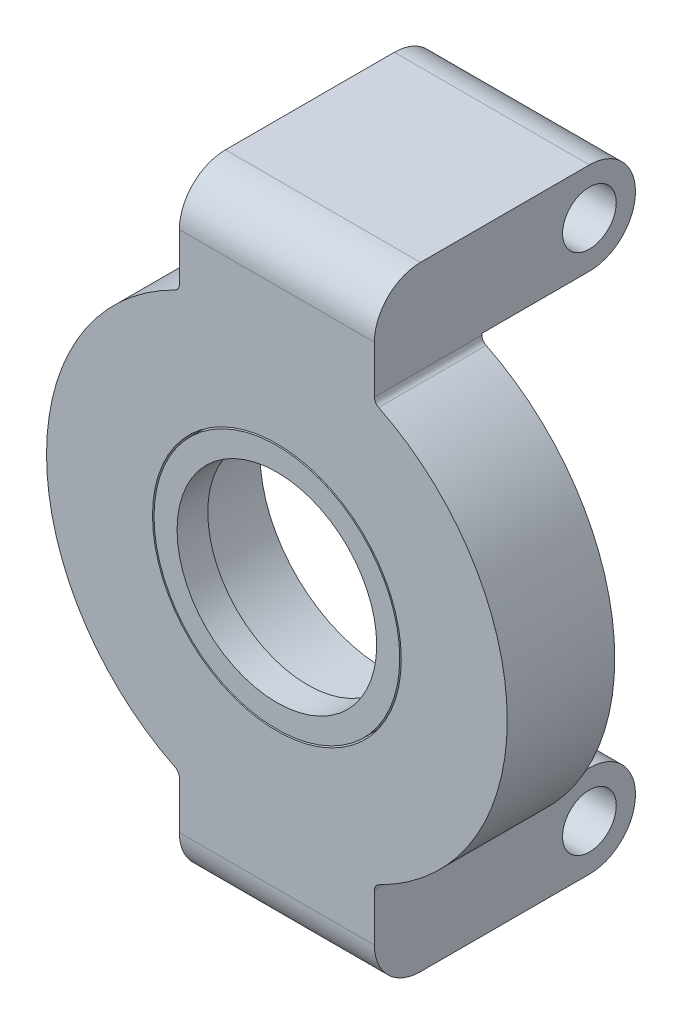
ISO-10303-21;
HEADER;
FILE_DESCRIPTION(('STEP AP214'),'2;1');
FILE_NAME('part.step','',(''),(''),'','','');
FILE_SCHEMA(('AUTOMOTIVE_DESIGN { 1 0 10303 214 1 1 1 1 }'));
ENDSEC;
DATA;
#1=APPLICATION_CONTEXT('core data for automotive mechanical design processes');
#2=APPLICATION_PROTOCOL_DEFINITION('international standard','automotive_design',2000,#1);
#3=PRODUCT_CONTEXT('',#1,'mechanical');
#4=PRODUCT('Part','Part','',(#3));
#5=PRODUCT_RELATED_PRODUCT_CATEGORY('part','',(#4));
#6=PRODUCT_DEFINITION_FORMATION('','',#4);
#7=PRODUCT_DEFINITION_CONTEXT('part definition',#1,'design');
#8=PRODUCT_DEFINITION('design','',#6,#7);
#9=PRODUCT_DEFINITION_SHAPE('','',#8);
#10=(LENGTH_UNIT() NAMED_UNIT(*) SI_UNIT(.MILLI.,.METRE.));
#11=(NAMED_UNIT(*) PLANE_ANGLE_UNIT() SI_UNIT($,.RADIAN.));
#12=(NAMED_UNIT(*) SI_UNIT($,.STERADIAN.) SOLID_ANGLE_UNIT());
#13=UNCERTAINTY_MEASURE_WITH_UNIT(LENGTH_MEASURE(1.E-05),#10,'distance_accuracy_value','');
#14=(GEOMETRIC_REPRESENTATION_CONTEXT(3) GLOBAL_UNCERTAINTY_ASSIGNED_CONTEXT((#13)) GLOBAL_UNIT_ASSIGNED_CONTEXT((#10,
#11,#12)) REPRESENTATION_CONTEXT('',''));
#15=CARTESIAN_POINT('',(0.,0.,0.));
#16=DIRECTION('',(0.,0.,1.));
#17=DIRECTION('',(1.,0.,0.));
#18=AXIS2_PLACEMENT_3D('',#15,#16,#17);
#19=CARTESIAN_POINT('',(0.,0.,5.));
#20=DIRECTION('',(0.,0.,1.));
#21=DIRECTION('',(1.,0.,0.));
#22=AXIS2_PLACEMENT_3D('',#19,#20,#21);
#23=CYLINDRICAL_SURFACE('',#22,7.99999999999999);
#24=CARTESIAN_POINT('',(0.,0.,5.));
#25=DIRECTION('',(0.,0.,1.));
#26=DIRECTION('',(1.,0.,0.));
#27=AXIS2_PLACEMENT_3D('',#24,#25,#26);
#28=CIRCLE('',#27,7.99999999999999);
#29=CARTESIAN_POINT('',(7.99999999999998,0.,5.));
#30=VERTEX_POINT('',#29);
#31=EDGE_CURVE('E11',#30,#30,#28,.T.);
#32=ORIENTED_EDGE('',*,*,#31,.T.);
#33=EDGE_LOOP('',(#32));
#34=FACE_BOUND('',#33,.T.);
#35=CARTESIAN_POINT('',(0.,0.,7.));
#36=DIRECTION('',(0.,0.,1.));
#37=DIRECTION('',(1.,0.,0.));
#38=AXIS2_PLACEMENT_3D('',#35,#36,#37);
#39=CIRCLE('',#38,7.99999999999999);
#40=CARTESIAN_POINT('',(7.99999999999998,0.,7.));
#41=VERTEX_POINT('',#40);
#42=EDGE_CURVE('E48',#41,#41,#39,.T.);
#43=ORIENTED_EDGE('',*,*,#42,.F.);
#44=EDGE_LOOP('',(#43));
#45=FACE_BOUND('',#44,.T.);
#46=ADVANCED_FACE('F45',(#34,#45),#23,.T.);
#47=CARTESIAN_POINT('',(0.,0.,5.));
#48=DIRECTION('',(0.,0.,1.));
#49=DIRECTION('',(1.,0.,0.));
#50=AXIS2_PLACEMENT_3D('',#47,#48,#49);
#51=PLANE('',#50);
#52=CARTESIAN_POINT('',(0.,0.,5.));
#53=DIRECTION('',(0.,0.,1.));
#54=DIRECTION('',(1.,0.,0.));
#55=AXIS2_PLACEMENT_3D('',#52,#53,#54);
#56=CIRCLE('',#55,6.5);
#57=CARTESIAN_POINT('',(6.5,0.,5.));
#58=VERTEX_POINT('',#57);
#59=EDGE_CURVE('E55',#58,#58,#56,.T.);
#60=ORIENTED_EDGE('',*,*,#59,.T.);
#61=EDGE_LOOP('',(#60));
#62=FACE_BOUND('',#61,.T.);
#63=ORIENTED_EDGE('',*,*,#31,.F.);
#64=EDGE_LOOP('',(#63));
#65=FACE_BOUND('',#64,.T.);
#66=ADVANCED_FACE('F63',(#62,#65),#51,.F.);
#67=CARTESIAN_POINT('',(0.,0.,7.));
#68=DIRECTION('',(0.,0.,1.));
#69=DIRECTION('',(1.,0.,0.));
#70=AXIS2_PLACEMENT_3D('',#67,#68,#69);
#71=PLANE('',#70);
#72=CARTESIAN_POINT('',(0.,0.,7.));
#73=DIRECTION('',(0.,0.,1.));
#74=DIRECTION('',(1.,0.,0.));
#75=AXIS2_PLACEMENT_3D('',#72,#73,#74);
#76=CIRCLE('',#75,6.5);
#77=CARTESIAN_POINT('',(6.5,0.,7.));
#78=VERTEX_POINT('',#77);
#79=EDGE_CURVE('E57',#78,#78,#76,.T.);
#80=ORIENTED_EDGE('',*,*,#79,.F.);
#81=EDGE_LOOP('',(#80));
#82=FACE_BOUND('',#81,.T.);
#83=ORIENTED_EDGE('',*,*,#42,.T.);
#84=EDGE_LOOP('',(#83));
#85=FACE_BOUND('',#84,.T.);
#86=ADVANCED_FACE('F69',(#82,#85),#71,.T.);
#87=CARTESIAN_POINT('',(0.,0.,5.));
#88=DIRECTION('',(0.,0.,1.));
#89=DIRECTION('',(1.,0.,0.));
#90=AXIS2_PLACEMENT_3D('',#87,#88,#89);
#91=CYLINDRICAL_SURFACE('',#90,6.5);
#92=ORIENTED_EDGE('',*,*,#59,.F.);
#93=EDGE_LOOP('',(#92));
#94=FACE_BOUND('',#93,.T.);
#95=ORIENTED_EDGE('',*,*,#79,.T.);
#96=EDGE_LOOP('',(#95));
#97=FACE_BOUND('',#96,.T.);
#98=ADVANCED_FACE('F66',(#94,#97),#91,.F.);
#99=CLOSED_SHELL('',(#46,#66,#86,#98));
#100=MANIFOLD_SOLID_BREP('B2',#99);
#101=CARTESIAN_POINT('',(0.,0.,0.));
#102=DIRECTION('',(0.,0.,1.));
#103=DIRECTION('',(1.,0.,0.));
#104=AXIS2_PLACEMENT_3D('',#101,#102,#103);
#105=PLANE('',#104);
#106=CARTESIAN_POINT('',(0.,0.,0.));
#107=DIRECTION('',(0.,0.,1.));
#108=DIRECTION('',(1.,0.,0.));
#109=AXIS2_PLACEMENT_3D('',#106,#107,#108);
#110=CIRCLE('',#109,8.1);
#111=CARTESIAN_POINT('',(8.1,0.,0.));
#112=VERTEX_POINT('',#111);
#113=EDGE_CURVE('E288',#112,#112,#110,.T.);
#114=ORIENTED_EDGE('',*,*,#113,.T.);
#115=EDGE_LOOP('',(#114));
#116=FACE_BOUND('',#115,.T.);
#117=DIRECTION('',(1.,0.,0.));
#118=VECTOR('',#117,1.);
#119=CARTESIAN_POINT('',(6.34999999999999,-14.,0.));
#120=LINE('',#119,#118);
#121=CARTESIAN_POINT('',(-6.35,-14.,0.));
#122=VERTEX_POINT('',#121);
#123=CARTESIAN_POINT('',(6.35,-14.,0.));
#124=VERTEX_POINT('',#123);
#125=EDGE_CURVE('E269',#122,#124,#120,.T.);
#126=ORIENTED_EDGE('',*,*,#125,.F.);
#127=DIRECTION('',(0.,-1.,0.));
#128=VECTOR('',#127,1.);
#129=CARTESIAN_POINT('',(-6.35,-20.,0.));
#130=LINE('',#129,#128);
#131=CARTESIAN_POINT('',(-6.35,-13.9042259762994,0.));
#132=VERTEX_POINT('',#131);
#133=EDGE_CURVE('E252',#132,#122,#130,.T.);
#134=ORIENTED_EDGE('',*,*,#133,.F.);
#135=CARTESIAN_POINT('',(-6.85,-13.9042259762994,0.));
#136=DIRECTION('',(0.,0.,1.));
#137=DIRECTION('',(1.,0.,0.));
#138=AXIS2_PLACEMENT_3D('',#135,#136,#137);
#139=CIRCLE('',#138,0.5);
#140=CARTESIAN_POINT('',(-6.62903225806452,-13.4557025577091,0.));
#141=VERTEX_POINT('',#140);
#142=EDGE_CURVE('E406',#132,#141,#139,.T.);
#143=ORIENTED_EDGE('',*,*,#142,.T.);
#144=CARTESIAN_POINT('',(0.,0.,0.));
#145=DIRECTION('',(0.,0.,1.));
#146=DIRECTION('',(1.,0.,0.));
#147=AXIS2_PLACEMENT_3D('',#144,#145,#146);
#148=CIRCLE('',#147,15.);
#149=CARTESIAN_POINT('',(-6.62903225806452,13.4557025577091,0.));
#150=VERTEX_POINT('',#149);
#151=EDGE_CURVE('E262',#150,#141,#148,.T.);
#152=ORIENTED_EDGE('',*,*,#151,.F.);
#153=CARTESIAN_POINT('',(-6.85,13.9042259762994,0.));
#154=DIRECTION('',(0.,0.,1.));
#155=DIRECTION('',(1.,0.,0.));
#156=AXIS2_PLACEMENT_3D('',#153,#154,#155);
#157=CIRCLE('',#156,0.5);
#158=CARTESIAN_POINT('',(-6.35,13.9042259762994,0.));
#159=VERTEX_POINT('',#158);
#160=EDGE_CURVE('E402',#150,#159,#157,.T.);
#161=ORIENTED_EDGE('',*,*,#160,.T.);
#162=DIRECTION('',(0.,-1.,0.));
#163=VECTOR('',#162,1.);
#164=CARTESIAN_POINT('',(-6.35,13.5896100017624,0.));
#165=LINE('',#164,#163);
#166=CARTESIAN_POINT('',(-6.35,14.,0.));
#167=VERTEX_POINT('',#166);
#168=EDGE_CURVE('E313',#167,#159,#165,.T.);
#169=ORIENTED_EDGE('',*,*,#168,.F.);
#170=DIRECTION('',(-1.,0.,0.));
#171=VECTOR('',#170,1.);
#172=CARTESIAN_POINT('',(6.35,14.,0.));
#173=LINE('',#172,#171);
#174=CARTESIAN_POINT('',(6.35,14.,0.));
#175=VERTEX_POINT('',#174);
#176=EDGE_CURVE('E277',#175,#167,#173,.T.);
#177=ORIENTED_EDGE('',*,*,#176,.F.);
#178=DIRECTION('',(0.,1.,0.));
#179=VECTOR('',#178,1.);
#180=CARTESIAN_POINT('',(6.35,13.5896100017624,0.));
#181=LINE('',#180,#179);
#182=CARTESIAN_POINT('',(6.35,13.9042259762994,0.));
#183=VERTEX_POINT('',#182);
#184=EDGE_CURVE('E292',#183,#175,#181,.T.);
#185=ORIENTED_EDGE('',*,*,#184,.F.);
#186=CARTESIAN_POINT('',(6.85,13.9042259762994,0.));
#187=DIRECTION('',(0.,0.,1.));
#188=DIRECTION('',(1.,0.,0.));
#189=AXIS2_PLACEMENT_3D('',#186,#187,#188);
#190=CIRCLE('',#189,0.5);
#191=CARTESIAN_POINT('',(6.62903225806452,13.4557025577091,0.));
#192=VERTEX_POINT('',#191);
#193=EDGE_CURVE('E123',#183,#192,#190,.T.);
#194=ORIENTED_EDGE('',*,*,#193,.T.);
#195=CARTESIAN_POINT('',(0.,0.,0.));
#196=DIRECTION('',(0.,0.,1.));
#197=DIRECTION('',(1.,0.,0.));
#198=AXIS2_PLACEMENT_3D('',#195,#196,#197);
#199=CIRCLE('',#198,15.);
#200=CARTESIAN_POINT('',(6.62903225806452,-13.4557025577091,0.));
#201=VERTEX_POINT('',#200);
#202=EDGE_CURVE('E298',#201,#192,#199,.T.);
#203=ORIENTED_EDGE('',*,*,#202,.F.);
#204=CARTESIAN_POINT('',(6.85,-13.9042259762994,0.));
#205=DIRECTION('',(0.,0.,1.));
#206=DIRECTION('',(1.,0.,0.));
#207=AXIS2_PLACEMENT_3D('',#204,#205,#206);
#208=CIRCLE('',#207,0.5);
#209=CARTESIAN_POINT('',(6.35,-13.9042259762994,0.));
#210=VERTEX_POINT('',#209);
#211=EDGE_CURVE('E410',#201,#210,#208,.T.);
#212=ORIENTED_EDGE('',*,*,#211,.T.);
#213=DIRECTION('',(0.,1.,0.));
#214=VECTOR('',#213,1.);
#215=CARTESIAN_POINT('',(6.35,-20.,0.));
#216=LINE('',#215,#214);
#217=EDGE_CURVE('E261',#124,#210,#216,.T.);
#218=ORIENTED_EDGE('',*,*,#217,.F.);
#219=EDGE_LOOP('',(#126,#134,#143,#152,#161,#169,#177,#185,#194,#203,#212,#218));
#220=FACE_BOUND('',#219,.T.);
#221=ADVANCED_FACE('F115',(#116,#220),#105,.F.);
#222=CARTESIAN_POINT('',(0.,0.,7.));
#223=DIRECTION('',(0.,0.,1.));
#224=DIRECTION('',(1.,0.,0.));
#225=AXIS2_PLACEMENT_3D('',#222,#223,#224);
#226=PLANE('',#225);
#227=CARTESIAN_POINT('',(0.,0.,7.));
#228=DIRECTION('',(0.,0.,1.));
#229=DIRECTION('',(1.,0.,0.));
#230=AXIS2_PLACEMENT_3D('',#227,#228,#229);
#231=CIRCLE('',#230,15.);
#232=CARTESIAN_POINT('',(-6.62903225806452,13.4557025577091,7.));
#233=VERTEX_POINT('',#232);
#234=CARTESIAN_POINT('',(-6.62903225806452,-13.4557025577091,7.));
#235=VERTEX_POINT('',#234);
#236=EDGE_CURVE('E301',#233,#235,#231,.T.);
#237=ORIENTED_EDGE('',*,*,#236,.T.);
#238=CARTESIAN_POINT('',(-6.85,-13.9042259762994,7.));
#239=DIRECTION('',(0.,0.,1.));
#240=DIRECTION('',(1.,0.,0.));
#241=AXIS2_PLACEMENT_3D('',#238,#239,#240);
#242=CIRCLE('',#241,0.5);
#243=CARTESIAN_POINT('',(-6.35,-13.9042259762994,7.));
#244=VERTEX_POINT('',#243);
#245=EDGE_CURVE('E408',#235,#244,#242,.F.);
#246=ORIENTED_EDGE('',*,*,#245,.T.);
#247=DIRECTION('',(0.,-1.,0.));
#248=VECTOR('',#247,1.);
#249=CARTESIAN_POINT('',(-6.35,-20.,7.));
#250=LINE('',#249,#248);
#251=CARTESIAN_POINT('',(-6.35,-17.,7.));
#252=VERTEX_POINT('',#251);
#253=EDGE_CURVE('E304',#244,#252,#250,.T.);
#254=ORIENTED_EDGE('',*,*,#253,.T.);
#255=DIRECTION('',(1.,0.,0.));
#256=VECTOR('',#255,1.);
#257=CARTESIAN_POINT('',(6.35,-17.,7.));
#258=LINE('',#257,#256);
#259=CARTESIAN_POINT('',(6.35,-17.,7.));
#260=VERTEX_POINT('',#259);
#261=EDGE_CURVE('E368',#252,#260,#258,.T.);
#262=ORIENTED_EDGE('',*,*,#261,.T.);
#263=DIRECTION('',(0.,1.,0.));
#264=VECTOR('',#263,1.);
#265=CARTESIAN_POINT('',(6.35,-20.,7.));
#266=LINE('',#265,#264);
#267=CARTESIAN_POINT('',(6.35,-13.9042259762994,7.));
#268=VERTEX_POINT('',#267);
#269=EDGE_CURVE('E306',#260,#268,#266,.T.);
#270=ORIENTED_EDGE('',*,*,#269,.T.);
#271=CARTESIAN_POINT('',(6.85,-13.9042259762994,7.));
#272=DIRECTION('',(0.,0.,1.));
#273=DIRECTION('',(1.,0.,0.));
#274=AXIS2_PLACEMENT_3D('',#271,#272,#273);
#275=CIRCLE('',#274,0.5);
#276=CARTESIAN_POINT('',(6.62903225806452,-13.4557025577091,7.));
#277=VERTEX_POINT('',#276);
#278=EDGE_CURVE('E412',#268,#277,#275,.F.);
#279=ORIENTED_EDGE('',*,*,#278,.T.);
#280=CARTESIAN_POINT('',(0.,0.,7.));
#281=DIRECTION('',(0.,0.,1.));
#282=DIRECTION('',(1.,0.,0.));
#283=AXIS2_PLACEMENT_3D('',#280,#281,#282);
#284=CIRCLE('',#283,15.);
#285=CARTESIAN_POINT('',(6.62903225806452,13.4557025577091,7.));
#286=VERTEX_POINT('',#285);
#287=EDGE_CURVE('E309',#277,#286,#284,.T.);
#288=ORIENTED_EDGE('',*,*,#287,.T.);
#289=CARTESIAN_POINT('',(6.85,13.9042259762994,7.));
#290=DIRECTION('',(0.,0.,1.));
#291=DIRECTION('',(1.,0.,0.));
#292=AXIS2_PLACEMENT_3D('',#289,#290,#291);
#293=CIRCLE('',#292,0.5);
#294=CARTESIAN_POINT('',(6.35,13.9042259762994,7.));
#295=VERTEX_POINT('',#294);
#296=EDGE_CURVE('E43',#286,#295,#293,.F.);
#297=ORIENTED_EDGE('',*,*,#296,.T.);
#298=DIRECTION('',(0.,1.,0.));
#299=VECTOR('',#298,1.);
#300=CARTESIAN_POINT('',(6.35,13.5896100017624,7.));
#301=LINE('',#300,#299);
#302=CARTESIAN_POINT('',(6.35,17.,7.));
#303=VERTEX_POINT('',#302);
#304=EDGE_CURVE('E295',#295,#303,#301,.T.);
#305=ORIENTED_EDGE('',*,*,#304,.T.);
#306=DIRECTION('',(-1.,0.,0.));
#307=VECTOR('',#306,1.);
#308=CARTESIAN_POINT('',(-6.35,17.,7.));
#309=LINE('',#308,#307);
#310=CARTESIAN_POINT('',(-6.35,17.,7.));
#311=VERTEX_POINT('',#310);
#312=EDGE_CURVE('E356',#303,#311,#309,.T.);
#313=ORIENTED_EDGE('',*,*,#312,.T.);
#314=DIRECTION('',(0.,-1.,0.));
#315=VECTOR('',#314,1.);
#316=CARTESIAN_POINT('',(-6.35,13.5896100017624,7.));
#317=LINE('',#316,#315);
#318=CARTESIAN_POINT('',(-6.35,13.9042259762994,7.));
#319=VERTEX_POINT('',#318);
#320=EDGE_CURVE('E297',#311,#319,#317,.T.);
#321=ORIENTED_EDGE('',*,*,#320,.T.);
#322=CARTESIAN_POINT('',(-6.85,13.9042259762994,7.));
#323=DIRECTION('',(0.,0.,1.));
#324=DIRECTION('',(1.,0.,0.));
#325=AXIS2_PLACEMENT_3D('',#322,#323,#324);
#326=CIRCLE('',#325,0.5);
#327=EDGE_CURVE('E404',#319,#233,#326,.F.);
#328=ORIENTED_EDGE('',*,*,#327,.T.);
#329=EDGE_LOOP('',(#237,#246,#254,#262,#270,#279,#288,#297,#305,#313,#321,#328));
#330=FACE_BOUND('',#329,.T.);
#331=CARTESIAN_POINT('',(0.,0.,7.));
#332=DIRECTION('',(0.,0.,1.));
#333=DIRECTION('',(1.,0.,0.));
#334=AXIS2_PLACEMENT_3D('',#331,#332,#333);
#335=CIRCLE('',#334,8.1);
#336=CARTESIAN_POINT('',(8.1,0.,7.));
#337=VERTEX_POINT('',#336);
#338=EDGE_CURVE('E289',#337,#337,#335,.T.);
#339=ORIENTED_EDGE('',*,*,#338,.F.);
#340=EDGE_LOOP('',(#339));
#341=FACE_BOUND('',#340,.T.);
#342=ADVANCED_FACE('F426',(#330,#341),#226,.T.);
#343=CARTESIAN_POINT('',(6.35,13.5896100017624,7.));
#344=DIRECTION('',(-1.,0.,0.));
#345=DIRECTION('',(0.,0.,1.));
#346=AXIS2_PLACEMENT_3D('',#343,#344,#345);
#347=PLANE('',#346);
#348=CARTESIAN_POINT('',(6.35,17.,-7.));
#349=DIRECTION('',(1.,0.,0.));
#350=DIRECTION('',(0.,0.,-1.));
#351=AXIS2_PLACEMENT_3D('',#348,#349,#350);
#352=CIRCLE('',#351,1.75);
#353=CARTESIAN_POINT('',(6.35,17.,-8.75));
#354=VERTEX_POINT('',#353);
#355=EDGE_CURVE('E770',#354,#354,#352,.T.);
#356=ORIENTED_EDGE('',*,*,#355,.F.);
#357=EDGE_LOOP('',(#356));
#358=FACE_BOUND('',#357,.T.);
#359=ORIENTED_EDGE('',*,*,#304,.F.);
#360=DIRECTION('',(0.,0.,1.));
#361=VECTOR('',#360,1.);
#362=CARTESIAN_POINT('',(6.35,13.9042259762994,0.));
#363=LINE('',#362,#361);
#364=EDGE_CURVE('E400',#295,#183,#363,.F.);
#365=ORIENTED_EDGE('',*,*,#364,.T.);
#366=ORIENTED_EDGE('',*,*,#184,.T.);
#367=DIRECTION('',(0.,0.,1.));
#368=VECTOR('',#367,1.);
#369=CARTESIAN_POINT('',(6.35,14.,-10.));
#370=LINE('',#369,#368);
#371=CARTESIAN_POINT('',(6.35,14.,-7.));
#372=VERTEX_POINT('',#371);
#373=EDGE_CURVE('E285',#372,#175,#370,.T.);
#374=ORIENTED_EDGE('',*,*,#373,.F.);
#375=CARTESIAN_POINT('',(6.35,17.,-7.));
#376=DIRECTION('',(-1.,0.,0.));
#377=DIRECTION('',(0.,0.,1.));
#378=AXIS2_PLACEMENT_3D('',#375,#376,#377);
#379=CIRCLE('',#378,3.);
#380=CARTESIAN_POINT('',(6.35,17.,-10.));
#381=VERTEX_POINT('',#380);
#382=EDGE_CURVE('E338',#372,#381,#379,.F.);
#383=ORIENTED_EDGE('',*,*,#382,.T.);
#384=CARTESIAN_POINT('',(6.35,17.,-7.));
#385=DIRECTION('',(-1.,0.,0.));
#386=DIRECTION('',(0.,0.,1.));
#387=AXIS2_PLACEMENT_3D('',#384,#385,#386);
#388=CIRCLE('',#387,3.);
#389=CARTESIAN_POINT('',(6.35,20.,-7.));
#390=VERTEX_POINT('',#389);
#391=EDGE_CURVE('E335',#381,#390,#388,.F.);
#392=ORIENTED_EDGE('',*,*,#391,.T.);
#393=DIRECTION('',(0.,0.,-1.));
#394=VECTOR('',#393,1.);
#395=CARTESIAN_POINT('',(6.35,20.,7.));
#396=LINE('',#395,#394);
#397=CARTESIAN_POINT('',(6.35,20.,4.));
#398=VERTEX_POINT('',#397);
#399=EDGE_CURVE('E326',#398,#390,#396,.T.);
#400=ORIENTED_EDGE('',*,*,#399,.F.);
#401=CARTESIAN_POINT('',(6.35,17.,4.));
#402=DIRECTION('',(-1.,0.,0.));
#403=DIRECTION('',(0.,0.,1.));
#404=AXIS2_PLACEMENT_3D('',#401,#402,#403);
#405=CIRCLE('',#404,3.);
#406=EDGE_CURVE('E382',#398,#303,#405,.F.);
#407=ORIENTED_EDGE('',*,*,#406,.T.);
#408=EDGE_LOOP('',(#359,#365,#366,#374,#383,#392,#400,#407));
#409=FACE_BOUND('',#408,.T.);
#410=ADVANCED_FACE('F421',(#358,#409),#347,.F.);
#411=CARTESIAN_POINT('',(-6.35,20.,7.));
#412=DIRECTION('',(0.,-1.,0.));
#413=DIRECTION('',(0.,0.,-1.));
#414=AXIS2_PLACEMENT_3D('',#411,#412,#413);
#415=PLANE('',#414);
#416=DIRECTION('',(0.,0.,-1.));
#417=VECTOR('',#416,1.);
#418=CARTESIAN_POINT('',(-6.35,20.,7.));
#419=LINE('',#418,#417);
#420=CARTESIAN_POINT('',(-6.35,20.,4.));
#421=VERTEX_POINT('',#420);
#422=CARTESIAN_POINT('',(-6.35,20.,-7.));
#423=VERTEX_POINT('',#422);
#424=EDGE_CURVE('E324',#421,#423,#419,.T.);
#425=ORIENTED_EDGE('',*,*,#424,.F.);
#426=DIRECTION('',(-1.,0.,0.));
#427=VECTOR('',#426,1.);
#428=CARTESIAN_POINT('',(6.35,20.,4.));
#429=LINE('',#428,#427);
#430=EDGE_CURVE('E380',#421,#398,#429,.F.);
#431=ORIENTED_EDGE('',*,*,#430,.T.);
#432=ORIENTED_EDGE('',*,*,#399,.T.);
#433=DIRECTION('',(1.,0.,0.));
#434=VECTOR('',#433,1.);
#435=CARTESIAN_POINT('',(-6.35,20.,-7.));
#436=LINE('',#435,#434);
#437=EDGE_CURVE('E340',#390,#423,#436,.F.);
#438=ORIENTED_EDGE('',*,*,#437,.T.);
#439=EDGE_LOOP('',(#425,#431,#432,#438));
#440=FACE_BOUND('',#439,.T.);
#441=ADVANCED_FACE('F493',(#440),#415,.F.);
#442=CARTESIAN_POINT('',(-6.35,13.5896100017624,7.));
#443=DIRECTION('',(1.,0.,0.));
#444=DIRECTION('',(0.,0.,-1.));
#445=AXIS2_PLACEMENT_3D('',#442,#443,#444);
#446=PLANE('',#445);
#447=CARTESIAN_POINT('',(-6.35,17.,-7.));
#448=DIRECTION('',(1.,0.,0.));
#449=DIRECTION('',(0.,0.,-1.));
#450=AXIS2_PLACEMENT_3D('',#447,#448,#449);
#451=CIRCLE('',#450,1.75);
#452=CARTESIAN_POINT('',(-6.35,17.,-8.75));
#453=VERTEX_POINT('',#452);
#454=EDGE_CURVE('E362',#453,#453,#451,.T.);
#455=ORIENTED_EDGE('',*,*,#454,.T.);
#456=EDGE_LOOP('',(#455));
#457=FACE_BOUND('',#456,.T.);
#458=ORIENTED_EDGE('',*,*,#168,.T.);
#459=DIRECTION('',(0.,0.,1.));
#460=VECTOR('',#459,1.);
#461=CARTESIAN_POINT('',(-6.35,13.9042259762994,7.));
#462=LINE('',#461,#460);
#463=EDGE_CURVE('E390',#159,#319,#462,.T.);
#464=ORIENTED_EDGE('',*,*,#463,.T.);
#465=ORIENTED_EDGE('',*,*,#320,.F.);
#466=CARTESIAN_POINT('',(-6.35,17.,4.));
#467=DIRECTION('',(1.,0.,0.));
#468=DIRECTION('',(0.,0.,-1.));
#469=AXIS2_PLACEMENT_3D('',#466,#467,#468);
#470=CIRCLE('',#469,3.);
#471=EDGE_CURVE('E378',#311,#421,#470,.F.);
#472=ORIENTED_EDGE('',*,*,#471,.T.);
#473=ORIENTED_EDGE('',*,*,#424,.T.);
#474=CARTESIAN_POINT('',(-6.35,17.,-7.));
#475=DIRECTION('',(1.,0.,0.));
#476=DIRECTION('',(0.,0.,-1.));
#477=AXIS2_PLACEMENT_3D('',#474,#475,#476);
#478=CIRCLE('',#477,3.);
#479=CARTESIAN_POINT('',(-6.35,17.,-10.));
#480=VERTEX_POINT('',#479);
#481=EDGE_CURVE('E328',#423,#480,#478,.F.);
#482=ORIENTED_EDGE('',*,*,#481,.T.);
#483=CARTESIAN_POINT('',(-6.35,17.,-7.));
#484=DIRECTION('',(1.,0.,0.));
#485=DIRECTION('',(0.,0.,-1.));
#486=AXIS2_PLACEMENT_3D('',#483,#484,#485);
#487=CIRCLE('',#486,3.);
#488=CARTESIAN_POINT('',(-6.35,14.,-7.));
#489=VERTEX_POINT('',#488);
#490=EDGE_CURVE('E330',#480,#489,#487,.F.);
#491=ORIENTED_EDGE('',*,*,#490,.T.);
#492=DIRECTION('',(0.,0.,1.));
#493=VECTOR('',#492,1.);
#494=CARTESIAN_POINT('',(-6.35,14.,-10.));
#495=LINE('',#494,#493);
#496=EDGE_CURVE('E280',#489,#167,#495,.T.);
#497=ORIENTED_EDGE('',*,*,#496,.T.);
#498=EDGE_LOOP('',(#458,#464,#465,#472,#473,#482,#491,#497));
#499=FACE_BOUND('',#498,.T.);
#500=ADVANCED_FACE('F432',(#457,#499),#446,.F.);
#501=CARTESIAN_POINT('',(0.,0.,7.));
#502=DIRECTION('',(0.,0.,-1.));
#503=DIRECTION('',(-1.,0.,0.));
#504=AXIS2_PLACEMENT_3D('',#501,#502,#503);
#505=CYLINDRICAL_SURFACE('',#504,15.);
#506=ORIENTED_EDGE('',*,*,#236,.F.);
#507=DIRECTION('',(0.,0.,-1.));
#508=VECTOR('',#507,1.);
#509=CARTESIAN_POINT('',(-6.62903225806452,13.4557025577091,7.));
#510=LINE('',#509,#508);
#511=EDGE_CURVE('E387',#233,#150,#510,.T.);
#512=ORIENTED_EDGE('',*,*,#511,.T.);
#513=ORIENTED_EDGE('',*,*,#151,.T.);
#514=DIRECTION('',(0.,0.,-1.));
#515=VECTOR('',#514,1.);
#516=CARTESIAN_POINT('',(-6.62903225806452,-13.4557025577091,7.));
#517=LINE('',#516,#515);
#518=EDGE_CURVE('E385',#141,#235,#517,.F.);
#519=ORIENTED_EDGE('',*,*,#518,.T.);
#520=EDGE_LOOP('',(#506,#512,#513,#519));
#521=FACE_BOUND('',#520,.T.);
#522=ADVANCED_FACE('F442',(#521),#505,.T.);
#523=CARTESIAN_POINT('',(-6.35,-20.,7.));
#524=DIRECTION('',(1.,0.,0.));
#525=DIRECTION('',(0.,0.,-1.));
#526=AXIS2_PLACEMENT_3D('',#523,#524,#525);
#527=PLANE('',#526);
#528=CARTESIAN_POINT('',(-6.35,-17.,-7.));
#529=DIRECTION('',(1.,0.,0.));
#530=DIRECTION('',(0.,0.,-1.));
#531=AXIS2_PLACEMENT_3D('',#528,#529,#530);
#532=CIRCLE('',#531,1.75);
#533=CARTESIAN_POINT('',(-6.35,-17.,-8.75));
#534=VERTEX_POINT('',#533);
#535=EDGE_CURVE('E365',#534,#534,#532,.T.);
#536=ORIENTED_EDGE('',*,*,#535,.T.);
#537=EDGE_LOOP('',(#536));
#538=FACE_BOUND('',#537,.T.);
#539=ORIENTED_EDGE('',*,*,#253,.F.);
#540=DIRECTION('',(0.,0.,1.));
#541=VECTOR('',#540,1.);
#542=CARTESIAN_POINT('',(-6.35,-13.9042259762994,0.));
#543=LINE('',#542,#541);
#544=EDGE_CURVE('E258',#244,#132,#543,.F.);
#545=ORIENTED_EDGE('',*,*,#544,.T.);
#546=ORIENTED_EDGE('',*,*,#133,.T.);
#547=DIRECTION('',(0.,0.,1.));
#548=VECTOR('',#547,1.);
#549=CARTESIAN_POINT('',(-6.35,-14.,-10.));
#550=LINE('',#549,#548);
#551=CARTESIAN_POINT('',(-6.35,-14.,-7.));
#552=VERTEX_POINT('',#551);
#553=EDGE_CURVE('E256',#552,#122,#550,.T.);
#554=ORIENTED_EDGE('',*,*,#553,.F.);
#555=CARTESIAN_POINT('',(-6.35,-17.,-7.));
#556=DIRECTION('',(1.,0.,0.));
#557=DIRECTION('',(0.,0.,-1.));
#558=AXIS2_PLACEMENT_3D('',#555,#556,#557);
#559=CIRCLE('',#558,3.);
#560=CARTESIAN_POINT('',(-6.35,-17.,-10.));
#561=VERTEX_POINT('',#560);
#562=EDGE_CURVE('E351',#552,#561,#559,.F.);
#563=ORIENTED_EDGE('',*,*,#562,.T.);
#564=CARTESIAN_POINT('',(-6.35,-17.,-7.));
#565=DIRECTION('',(1.,0.,0.));
#566=DIRECTION('',(0.,0.,-1.));
#567=AXIS2_PLACEMENT_3D('',#564,#565,#566);
#568=CIRCLE('',#567,3.);
#569=CARTESIAN_POINT('',(-6.35,-20.,-7.));
#570=VERTEX_POINT('',#569);
#571=EDGE_CURVE('E348',#561,#570,#568,.F.);
#572=ORIENTED_EDGE('',*,*,#571,.T.);
#573=DIRECTION('',(0.,0.,-1.));
#574=VECTOR('',#573,1.);
#575=CARTESIAN_POINT('',(-6.35,-20.,7.));
#576=LINE('',#575,#574);
#577=CARTESIAN_POINT('',(-6.35,-20.,4.));
#578=VERTEX_POINT('',#577);
#579=EDGE_CURVE('E322',#578,#570,#576,.T.);
#580=ORIENTED_EDGE('',*,*,#579,.F.);
#581=CARTESIAN_POINT('',(-6.35,-17.,4.));
#582=DIRECTION('',(1.,0.,0.));
#583=DIRECTION('',(0.,0.,-1.));
#584=AXIS2_PLACEMENT_3D('',#581,#582,#583);
#585=CIRCLE('',#584,3.);
#586=EDGE_CURVE('E375',#578,#252,#585,.F.);
#587=ORIENTED_EDGE('',*,*,#586,.T.);
#588=EDGE_LOOP('',(#539,#545,#546,#554,#563,#572,#580,#587));
#589=FACE_BOUND('',#588,.T.);
#590=ADVANCED_FACE('F255',(#538,#589),#527,.F.);
#591=CARTESIAN_POINT('',(-6.35,-20.,7.));
#592=DIRECTION('',(0.,1.,0.));
#593=DIRECTION('',(0.,0.,1.));
#594=AXIS2_PLACEMENT_3D('',#591,#592,#593);
#595=PLANE('',#594);
#596=DIRECTION('',(0.,0.,-1.));
#597=VECTOR('',#596,1.);
#598=CARTESIAN_POINT('',(6.35,-20.,7.));
#599=LINE('',#598,#597);
#600=CARTESIAN_POINT('',(6.35,-20.,4.));
#601=VERTEX_POINT('',#600);
#602=CARTESIAN_POINT('',(6.35,-20.,-7.));
#603=VERTEX_POINT('',#602);
#604=EDGE_CURVE('E311',#601,#603,#599,.T.);
#605=ORIENTED_EDGE('',*,*,#604,.F.);
#606=DIRECTION('',(1.,0.,0.));
#607=VECTOR('',#606,1.);
#608=CARTESIAN_POINT('',(-6.35,-20.,4.));
#609=LINE('',#608,#607);
#610=EDGE_CURVE('E373',#601,#578,#609,.F.);
#611=ORIENTED_EDGE('',*,*,#610,.T.);
#612=ORIENTED_EDGE('',*,*,#579,.T.);
#613=DIRECTION('',(-1.,0.,0.));
#614=VECTOR('',#613,1.);
#615=CARTESIAN_POINT('',(-6.35,-20.,-7.));
#616=LINE('',#615,#614);
#617=EDGE_CURVE('E353',#570,#603,#616,.F.);
#618=ORIENTED_EDGE('',*,*,#617,.T.);
#619=EDGE_LOOP('',(#605,#611,#612,#618));
#620=FACE_BOUND('',#619,.T.);
#621=ADVANCED_FACE('F481',(#620),#595,.F.);
#622=CARTESIAN_POINT('',(6.35,-20.,7.));
#623=DIRECTION('',(-1.,0.,0.));
#624=DIRECTION('',(0.,0.,1.));
#625=AXIS2_PLACEMENT_3D('',#622,#623,#624);
#626=PLANE('',#625);
#627=CARTESIAN_POINT('',(6.35,-17.,-7.));
#628=DIRECTION('',(1.,0.,0.));
#629=DIRECTION('',(0.,0.,-1.));
#630=AXIS2_PLACEMENT_3D('',#627,#628,#629);
#631=CIRCLE('',#630,1.75);
#632=CARTESIAN_POINT('',(6.35,-17.,-8.75));
#633=VERTEX_POINT('',#632);
#634=EDGE_CURVE('E767',#633,#633,#631,.T.);
#635=ORIENTED_EDGE('',*,*,#634,.F.);
#636=EDGE_LOOP('',(#635));
#637=FACE_BOUND('',#636,.T.);
#638=ORIENTED_EDGE('',*,*,#217,.T.);
#639=DIRECTION('',(0.,0.,1.));
#640=VECTOR('',#639,1.);
#641=CARTESIAN_POINT('',(6.35,-13.9042259762994,7.));
#642=LINE('',#641,#640);
#643=EDGE_CURVE('E398',#210,#268,#642,.T.);
#644=ORIENTED_EDGE('',*,*,#643,.T.);
#645=ORIENTED_EDGE('',*,*,#269,.F.);
#646=CARTESIAN_POINT('',(6.35,-17.,4.));
#647=DIRECTION('',(-1.,0.,0.));
#648=DIRECTION('',(0.,0.,1.));
#649=AXIS2_PLACEMENT_3D('',#646,#647,#648);
#650=CIRCLE('',#649,3.);
#651=EDGE_CURVE('E371',#260,#601,#650,.F.);
#652=ORIENTED_EDGE('',*,*,#651,.T.);
#653=ORIENTED_EDGE('',*,*,#604,.T.);
#654=CARTESIAN_POINT('',(6.35,-17.,-7.));
#655=DIRECTION('',(-1.,0.,0.));
#656=DIRECTION('',(0.,0.,1.));
#657=AXIS2_PLACEMENT_3D('',#654,#655,#656);
#658=CIRCLE('',#657,3.);
#659=CARTESIAN_POINT('',(6.35,-17.,-10.));
#660=VERTEX_POINT('',#659);
#661=EDGE_CURVE('E343',#603,#660,#658,.F.);
#662=ORIENTED_EDGE('',*,*,#661,.T.);
#663=CARTESIAN_POINT('',(6.35,-17.,-7.));
#664=DIRECTION('',(-1.,0.,0.));
#665=DIRECTION('',(0.,0.,1.));
#666=AXIS2_PLACEMENT_3D('',#663,#664,#665);
#667=CIRCLE('',#666,3.);
#668=CARTESIAN_POINT('',(6.34999999999999,-14.,-7.));
#669=VERTEX_POINT('',#668);
#670=EDGE_CURVE('E345',#660,#669,#667,.F.);
#671=ORIENTED_EDGE('',*,*,#670,.T.);
#672=DIRECTION('',(0.,0.,1.));
#673=VECTOR('',#672,1.);
#674=CARTESIAN_POINT('',(6.34999999999999,-14.,-10.));
#675=LINE('',#674,#673);
#676=EDGE_CURVE('E273',#669,#124,#675,.T.);
#677=ORIENTED_EDGE('',*,*,#676,.T.);
#678=EDGE_LOOP('',(#638,#644,#645,#652,#653,#662,#671,#677));
#679=FACE_BOUND('',#678,.T.);
#680=ADVANCED_FACE('F456',(#637,#679),#626,.F.);
#681=CARTESIAN_POINT('',(0.,0.,7.));
#682=DIRECTION('',(0.,0.,-1.));
#683=DIRECTION('',(-1.,0.,0.));
#684=AXIS2_PLACEMENT_3D('',#681,#682,#683);
#685=CYLINDRICAL_SURFACE('',#684,15.);
#686=ORIENTED_EDGE('',*,*,#287,.F.);
#687=DIRECTION('',(0.,0.,-1.));
#688=VECTOR('',#687,1.);
#689=CARTESIAN_POINT('',(6.62903225806452,-13.4557025577091,7.));
#690=LINE('',#689,#688);
#691=EDGE_CURVE('E395',#277,#201,#690,.T.);
#692=ORIENTED_EDGE('',*,*,#691,.T.);
#693=ORIENTED_EDGE('',*,*,#202,.T.);
#694=DIRECTION('',(0.,0.,-1.));
#695=VECTOR('',#694,1.);
#696=CARTESIAN_POINT('',(6.62903225806452,13.4557025577091,7.));
#697=LINE('',#696,#695);
#698=EDGE_CURVE('E393',#192,#286,#697,.F.);
#699=ORIENTED_EDGE('',*,*,#698,.T.);
#700=EDGE_LOOP('',(#686,#692,#693,#699));
#701=FACE_BOUND('',#700,.T.);
#702=ADVANCED_FACE('F418',(#701),#685,.T.);
#703=CARTESIAN_POINT('',(0.,0.,7.));
#704=DIRECTION('',(0.,0.,-1.));
#705=DIRECTION('',(-1.,0.,0.));
#706=AXIS2_PLACEMENT_3D('',#703,#704,#705);
#707=CYLINDRICAL_SURFACE('',#706,8.1);
#708=ORIENTED_EDGE('',*,*,#338,.T.);
#709=EDGE_LOOP('',(#708));
#710=FACE_BOUND('',#709,.T.);
#711=ORIENTED_EDGE('',*,*,#113,.F.);
#712=EDGE_LOOP('',(#711));
#713=FACE_BOUND('',#712,.T.);
#714=ADVANCED_FACE('F478',(#710,#713),#707,.F.);
#715=CARTESIAN_POINT('',(6.35,14.,-10.));
#716=DIRECTION('',(0.,1.,0.));
#717=DIRECTION('',(0.,0.,1.));
#718=AXIS2_PLACEMENT_3D('',#715,#716,#717);
#719=PLANE('',#718);
#720=ORIENTED_EDGE('',*,*,#496,.F.);
#721=DIRECTION('',(-1.,0.,0.));
#722=VECTOR('',#721,1.);
#723=CARTESIAN_POINT('',(6.35,14.,-7.));
#724=LINE('',#723,#722);
#725=EDGE_CURVE('E332',#489,#372,#724,.F.);
#726=ORIENTED_EDGE('',*,*,#725,.T.);
#727=ORIENTED_EDGE('',*,*,#373,.T.);
#728=ORIENTED_EDGE('',*,*,#176,.T.);
#729=EDGE_LOOP('',(#720,#726,#727,#728));
#730=FACE_BOUND('',#729,.T.);
#731=ADVANCED_FACE('F616',(#730),#719,.F.);
#732=CARTESIAN_POINT('',(6.34999999999999,-14.,-10.));
#733=DIRECTION('',(0.,-1.,0.));
#734=DIRECTION('',(0.,0.,-1.));
#735=AXIS2_PLACEMENT_3D('',#732,#733,#734);
#736=PLANE('',#735);
#737=ORIENTED_EDGE('',*,*,#676,.F.);
#738=DIRECTION('',(1.,0.,0.));
#739=VECTOR('',#738,1.);
#740=CARTESIAN_POINT('',(6.34999999999999,-14.,-7.));
#741=LINE('',#740,#739);
#742=EDGE_CURVE('E272',#669,#552,#741,.F.);
#743=ORIENTED_EDGE('',*,*,#742,.T.);
#744=ORIENTED_EDGE('',*,*,#553,.T.);
#745=ORIENTED_EDGE('',*,*,#125,.T.);
#746=EDGE_LOOP('',(#737,#743,#744,#745));
#747=FACE_BOUND('',#746,.T.);
#748=ADVANCED_FACE('F268',(#747),#736,.F.);
#749=CARTESIAN_POINT('',(0.,17.,-7.));
#750=DIRECTION('',(-1.,0.,0.));
#751=DIRECTION('',(0.,0.,1.));
#752=AXIS2_PLACEMENT_3D('',#749,#750,#751);
#753=CYLINDRICAL_SURFACE('',#752,3.);
#754=ORIENTED_EDGE('',*,*,#437,.F.);
#755=ORIENTED_EDGE('',*,*,#391,.F.);
#756=DIRECTION('',(1.,0.,0.));
#757=VECTOR('',#756,1.);
#758=CARTESIAN_POINT('',(6.35,17.,-10.));
#759=LINE('',#758,#757);
#760=EDGE_CURVE('E274',#480,#381,#759,.T.);
#761=ORIENTED_EDGE('',*,*,#760,.F.);
#762=ORIENTED_EDGE('',*,*,#481,.F.);
#763=EDGE_LOOP('',(#754,#755,#761,#762));
#764=FACE_BOUND('',#763,.T.);
#765=ADVANCED_FACE('F505',(#764),#753,.T.);
#766=CARTESIAN_POINT('',(0.,17.,-7.));
#767=DIRECTION('',(1.,0.,0.));
#768=DIRECTION('',(0.,0.,-1.));
#769=AXIS2_PLACEMENT_3D('',#766,#767,#768);
#770=CYLINDRICAL_SURFACE('',#769,3.);
#771=ORIENTED_EDGE('',*,*,#382,.F.);
#772=ORIENTED_EDGE('',*,*,#725,.F.);
#773=ORIENTED_EDGE('',*,*,#490,.F.);
#774=ORIENTED_EDGE('',*,*,#760,.T.);
#775=EDGE_LOOP('',(#771,#772,#773,#774));
#776=FACE_BOUND('',#775,.T.);
#777=ADVANCED_FACE('F501',(#776),#770,.T.);
#778=CARTESIAN_POINT('',(0.,-17.,-7.));
#779=DIRECTION('',(-1.,0.,0.));
#780=DIRECTION('',(0.,0.,1.));
#781=AXIS2_PLACEMENT_3D('',#778,#779,#780);
#782=CYLINDRICAL_SURFACE('',#781,3.);
#783=ORIENTED_EDGE('',*,*,#617,.F.);
#784=ORIENTED_EDGE('',*,*,#571,.F.);
#785=DIRECTION('',(-1.,0.,0.));
#786=VECTOR('',#785,1.);
#787=CARTESIAN_POINT('',(0.,-17.,-10.));
#788=LINE('',#787,#786);
#789=EDGE_CURVE('E359',#660,#561,#788,.T.);
#790=ORIENTED_EDGE('',*,*,#789,.F.);
#791=ORIENTED_EDGE('',*,*,#661,.F.);
#792=EDGE_LOOP('',(#783,#784,#790,#791));
#793=FACE_BOUND('',#792,.T.);
#794=ADVANCED_FACE('F504',(#793),#782,.T.);
#795=CARTESIAN_POINT('',(0.,-17.,-7.));
#796=DIRECTION('',(1.,0.,0.));
#797=DIRECTION('',(0.,0.,-1.));
#798=AXIS2_PLACEMENT_3D('',#795,#796,#797);
#799=CYLINDRICAL_SURFACE('',#798,3.);
#800=ORIENTED_EDGE('',*,*,#562,.F.);
#801=ORIENTED_EDGE('',*,*,#742,.F.);
#802=ORIENTED_EDGE('',*,*,#670,.F.);
#803=ORIENTED_EDGE('',*,*,#789,.T.);
#804=EDGE_LOOP('',(#800,#801,#802,#803));
#805=FACE_BOUND('',#804,.T.);
#806=ADVANCED_FACE('F510',(#805),#799,.T.);
#807=CARTESIAN_POINT('',(-15.,-17.,-7.));
#808=DIRECTION('',(1.,0.,0.));
#809=DIRECTION('',(0.,0.,-1.));
#810=AXIS2_PLACEMENT_3D('',#807,#808,#809);
#811=CYLINDRICAL_SURFACE('',#810,1.75);
#812=CARTESIAN_POINT('',(6.35,-17.,-8.75));
#813=CARTESIAN_POINT('',(6.21770833333333,-17.,-8.75));
#814=CARTESIAN_POINT('',(6.08541666666666,-17.,-8.75));
#815=CARTESIAN_POINT('',(5.82083333333333,-17.,-8.75));
#816=CARTESIAN_POINT('',(5.68854166666666,-17.,-8.75));
#817=CARTESIAN_POINT('',(5.42395833333333,-17.,-8.75));
#818=CARTESIAN_POINT('',(5.29166666666666,-17.,-8.75));
#819=CARTESIAN_POINT('',(5.02708333333333,-17.,-8.75));
#820=CARTESIAN_POINT('',(4.89479166666666,-17.,-8.75));
#821=CARTESIAN_POINT('',(4.63020833333333,-17.,-8.75));
#822=CARTESIAN_POINT('',(4.49791666666666,-17.,-8.75));
#823=CARTESIAN_POINT('',(4.23333333333333,-17.,-8.75));
#824=CARTESIAN_POINT('',(4.10104166666666,-17.,-8.75));
#825=CARTESIAN_POINT('',(3.83645833333333,-17.,-8.75));
#826=CARTESIAN_POINT('',(3.70416666666666,-17.,-8.75));
#827=CARTESIAN_POINT('',(3.43958333333333,-17.,-8.75));
#828=CARTESIAN_POINT('',(3.30729166666666,-17.,-8.75));
#829=CARTESIAN_POINT('',(3.04270833333333,-17.,-8.75));
#830=CARTESIAN_POINT('',(2.91041666666666,-17.,-8.75));
#831=CARTESIAN_POINT('',(2.64583333333333,-17.,-8.75));
#832=CARTESIAN_POINT('',(2.51354166666666,-17.,-8.75));
#833=CARTESIAN_POINT('',(2.24895833333333,-17.,-8.75));
#834=CARTESIAN_POINT('',(2.11666666666666,-17.,-8.75));
#835=CARTESIAN_POINT('',(1.85208333333333,-17.,-8.75));
#836=CARTESIAN_POINT('',(1.71979166666666,-17.,-8.75));
#837=CARTESIAN_POINT('',(1.45520833333333,-17.,-8.75));
#838=CARTESIAN_POINT('',(1.32291666666666,-17.,-8.75));
#839=CARTESIAN_POINT('',(1.05833333333333,-17.,-8.75));
#840=CARTESIAN_POINT('',(0.926041666666664,-17.,-8.75));
#841=CARTESIAN_POINT('',(0.661458333333331,-17.,-8.75));
#842=CARTESIAN_POINT('',(0.529166666666664,-17.,-8.75));
#843=CARTESIAN_POINT('',(0.264583333333331,-17.,-8.75));
#844=CARTESIAN_POINT('',(0.132291666666665,-17.,-8.75));
#845=CARTESIAN_POINT('',(-0.132291666666668,-17.,-8.75));
#846=CARTESIAN_POINT('',(-0.264583333333335,-17.,-8.75));
#847=CARTESIAN_POINT('',(-0.529166666666669,-17.,-8.75));
#848=CARTESIAN_POINT('',(-0.661458333333336,-17.,-8.75));
#849=CARTESIAN_POINT('',(-0.926041666666669,-17.,-8.75));
#850=CARTESIAN_POINT('',(-1.05833333333333,-17.,-8.75));
#851=CARTESIAN_POINT('',(-1.32291666666667,-17.,-8.75));
#852=CARTESIAN_POINT('',(-1.45520833333333,-17.,-8.75));
#853=CARTESIAN_POINT('',(-1.71979166666667,-17.,-8.75));
#854=CARTESIAN_POINT('',(-1.85208333333334,-17.,-8.75));
#855=CARTESIAN_POINT('',(-2.11666666666667,-17.,-8.75));
#856=CARTESIAN_POINT('',(-2.24895833333334,-17.,-8.75));
#857=CARTESIAN_POINT('',(-2.51354166666667,-17.,-8.75));
#858=CARTESIAN_POINT('',(-2.64583333333333,-17.,-8.75));
#859=CARTESIAN_POINT('',(-2.91041666666667,-17.,-8.75));
#860=CARTESIAN_POINT('',(-3.04270833333333,-17.,-8.75));
#861=CARTESIAN_POINT('',(-3.30729166666667,-17.,-8.75));
#862=CARTESIAN_POINT('',(-3.43958333333333,-17.,-8.75));
#863=CARTESIAN_POINT('',(-3.70416666666667,-17.,-8.75));
#864=CARTESIAN_POINT('',(-3.83645833333334,-17.,-8.75));
#865=CARTESIAN_POINT('',(-4.10104166666667,-17.,-8.75));
#866=CARTESIAN_POINT('',(-4.23333333333333,-17.,-8.75));
#867=CARTESIAN_POINT('',(-4.49791666666667,-17.,-8.75));
#868=CARTESIAN_POINT('',(-4.63020833333333,-17.,-8.75));
#869=CARTESIAN_POINT('',(-4.89479166666667,-17.,-8.75));
#870=CARTESIAN_POINT('',(-5.02708333333333,-17.,-8.75));
#871=CARTESIAN_POINT('',(-5.29166666666667,-17.,-8.75));
#872=CARTESIAN_POINT('',(-5.42395833333333,-17.,-8.75));
#873=CARTESIAN_POINT('',(-5.68854166666667,-17.,-8.75));
#874=CARTESIAN_POINT('',(-5.82083333333333,-17.,-8.75));
#875=CARTESIAN_POINT('',(-6.08541666666667,-17.,-8.75));
#876=CARTESIAN_POINT('',(-6.21770833333333,-17.,-8.75));
#877=CARTESIAN_POINT('',(-6.35,-17.,-8.75));
#878=B_SPLINE_CURVE_WITH_KNOTS('',3,(#812,#813,#814,#815,#816,#817,#818,#819,#820,#821,#822,
#823,#824,#825,#826,#827,#828,#829,#830,#831,#832,#833,#834,#835,#836,#837,#838,#839,#840,#841,
#842,#843,#844,#845,#846,#847,#848,#849,#850,#851,#852,#853,#854,#855,#856,#857,#858,#859,#860,
#861,#862,#863,#864,#865,#866,#867,#868,#869,#870,#871,#872,#873,#874,#875,#876,#877),
.UNSPECIFIED.,.F.,.F.,(4,2,2,2,2,2,2,2,2,2,2,2,2,2,2,2,2,2,2,2,2,2,2,2,2,2,2,2,2,2,2,2,4),(0.,
0.396875000000001,0.793749999999999,1.190625,1.5875,1.984375,2.38125,2.778125,3.175,3.571875,
3.96875,4.365625,4.7625,5.159375,5.55625,5.953125,6.35,6.746875,7.14375,7.540625,7.9375,
8.334375,8.73125,9.128125,9.525,9.921875,10.31875,10.715625,11.1125,11.509375,11.90625,
12.303125,12.7),.UNSPECIFIED.);
#879=EDGE_CURVE('BSEAM513',#633,#534,#878,.T.);
#880=ORIENTED_EDGE('',*,*,#634,.T.);
#881=ORIENTED_EDGE('',*,*,#535,.F.);
#882=ORIENTED_EDGE('',*,*,#879,.T.);
#883=ORIENTED_EDGE('',*,*,#879,.F.);
#884=EDGE_LOOP('',(#880,#882,#881,#883));
#885=FACE_BOUND('',#884,.T.);
#886=ADVANCED_FACE('F513',(#885),#811,.F.);
#887=CARTESIAN_POINT('',(-15.,17.,-7.));
#888=DIRECTION('',(1.,0.,0.));
#889=DIRECTION('',(0.,0.,-1.));
#890=AXIS2_PLACEMENT_3D('',#887,#888,#889);
#891=CYLINDRICAL_SURFACE('',#890,1.75);
#892=CARTESIAN_POINT('',(6.35,17.,-8.75));
#893=CARTESIAN_POINT('',(6.21770833333333,17.,-8.75));
#894=CARTESIAN_POINT('',(6.08541666666666,17.,-8.75));
#895=CARTESIAN_POINT('',(5.82083333333333,17.,-8.75));
#896=CARTESIAN_POINT('',(5.68854166666666,17.,-8.75));
#897=CARTESIAN_POINT('',(5.42395833333333,17.,-8.75));
#898=CARTESIAN_POINT('',(5.29166666666666,17.,-8.75));
#899=CARTESIAN_POINT('',(5.02708333333333,17.,-8.75));
#900=CARTESIAN_POINT('',(4.89479166666666,17.,-8.75));
#901=CARTESIAN_POINT('',(4.63020833333333,17.,-8.75));
#902=CARTESIAN_POINT('',(4.49791666666666,17.,-8.75));
#903=CARTESIAN_POINT('',(4.23333333333333,17.,-8.75));
#904=CARTESIAN_POINT('',(4.10104166666666,17.,-8.75));
#905=CARTESIAN_POINT('',(3.83645833333333,17.,-8.75));
#906=CARTESIAN_POINT('',(3.70416666666666,17.,-8.75));
#907=CARTESIAN_POINT('',(3.43958333333333,17.,-8.75));
#908=CARTESIAN_POINT('',(3.30729166666666,17.,-8.75));
#909=CARTESIAN_POINT('',(3.04270833333333,17.,-8.75));
#910=CARTESIAN_POINT('',(2.91041666666666,17.,-8.75));
#911=CARTESIAN_POINT('',(2.64583333333333,17.,-8.75));
#912=CARTESIAN_POINT('',(2.51354166666666,17.,-8.75));
#913=CARTESIAN_POINT('',(2.24895833333333,17.,-8.75));
#914=CARTESIAN_POINT('',(2.11666666666666,17.,-8.75));
#915=CARTESIAN_POINT('',(1.85208333333333,17.,-8.75));
#916=CARTESIAN_POINT('',(1.71979166666666,17.,-8.75));
#917=CARTESIAN_POINT('',(1.45520833333333,17.,-8.75));
#918=CARTESIAN_POINT('',(1.32291666666666,17.,-8.75));
#919=CARTESIAN_POINT('',(1.05833333333333,17.,-8.75));
#920=CARTESIAN_POINT('',(0.926041666666664,17.,-8.75));
#921=CARTESIAN_POINT('',(0.661458333333331,17.,-8.75));
#922=CARTESIAN_POINT('',(0.529166666666664,17.,-8.75));
#923=CARTESIAN_POINT('',(0.264583333333331,17.,-8.75));
#924=CARTESIAN_POINT('',(0.132291666666665,17.,-8.75));
#925=CARTESIAN_POINT('',(-0.132291666666668,17.,-8.75));
#926=CARTESIAN_POINT('',(-0.264583333333335,17.,-8.75));
#927=CARTESIAN_POINT('',(-0.529166666666669,17.,-8.75));
#928=CARTESIAN_POINT('',(-0.661458333333336,17.,-8.75));
#929=CARTESIAN_POINT('',(-0.926041666666669,17.,-8.75));
#930=CARTESIAN_POINT('',(-1.05833333333333,17.,-8.75));
#931=CARTESIAN_POINT('',(-1.32291666666667,17.,-8.75));
#932=CARTESIAN_POINT('',(-1.45520833333333,17.,-8.75));
#933=CARTESIAN_POINT('',(-1.71979166666667,17.,-8.75));
#934=CARTESIAN_POINT('',(-1.85208333333334,17.,-8.75));
#935=CARTESIAN_POINT('',(-2.11666666666667,17.,-8.75));
#936=CARTESIAN_POINT('',(-2.24895833333334,17.,-8.75));
#937=CARTESIAN_POINT('',(-2.51354166666667,17.,-8.75));
#938=CARTESIAN_POINT('',(-2.64583333333333,17.,-8.75));
#939=CARTESIAN_POINT('',(-2.91041666666667,17.,-8.75));
#940=CARTESIAN_POINT('',(-3.04270833333333,17.,-8.75));
#941=CARTESIAN_POINT('',(-3.30729166666667,17.,-8.75));
#942=CARTESIAN_POINT('',(-3.43958333333333,17.,-8.75));
#943=CARTESIAN_POINT('',(-3.70416666666667,17.,-8.75));
#944=CARTESIAN_POINT('',(-3.83645833333334,17.,-8.75));
#945=CARTESIAN_POINT('',(-4.10104166666667,17.,-8.75));
#946=CARTESIAN_POINT('',(-4.23333333333333,17.,-8.75));
#947=CARTESIAN_POINT('',(-4.49791666666667,17.,-8.75));
#948=CARTESIAN_POINT('',(-4.63020833333333,17.,-8.75));
#949=CARTESIAN_POINT('',(-4.89479166666667,17.,-8.75));
#950=CARTESIAN_POINT('',(-5.02708333333333,17.,-8.75));
#951=CARTESIAN_POINT('',(-5.29166666666667,17.,-8.75));
#952=CARTESIAN_POINT('',(-5.42395833333333,17.,-8.75));
#953=CARTESIAN_POINT('',(-5.68854166666667,17.,-8.75));
#954=CARTESIAN_POINT('',(-5.82083333333333,17.,-8.75));
#955=CARTESIAN_POINT('',(-6.08541666666667,17.,-8.75));
#956=CARTESIAN_POINT('',(-6.21770833333333,17.,-8.75));
#957=CARTESIAN_POINT('',(-6.35,17.,-8.75));
#958=B_SPLINE_CURVE_WITH_KNOTS('',3,(#892,#893,#894,#895,#896,#897,#898,#899,#900,#901,#902,
#903,#904,#905,#906,#907,#908,#909,#910,#911,#912,#913,#914,#915,#916,#917,#918,#919,#920,#921,
#922,#923,#924,#925,#926,#927,#928,#929,#930,#931,#932,#933,#934,#935,#936,#937,#938,#939,#940,
#941,#942,#943,#944,#945,#946,#947,#948,#949,#950,#951,#952,#953,#954,#955,#956,#957),
.UNSPECIFIED.,.F.,.F.,(4,2,2,2,2,2,2,2,2,2,2,2,2,2,2,2,2,2,2,2,2,2,2,2,2,2,2,2,2,2,2,2,4),(0.,
0.396875000000001,0.793749999999999,1.190625,1.5875,1.984375,2.38125,2.778125,3.175,3.571875,
3.96875,4.365625,4.7625,5.159375,5.55625,5.953125,6.35,6.746875,7.14375,7.540625,7.9375,
8.334375,8.73125,9.128125,9.525,9.921875,10.31875,10.715625,11.1125,11.509375,11.90625,
12.303125,12.7),.UNSPECIFIED.);
#959=EDGE_CURVE('BSEAM521',#354,#453,#958,.T.);
#960=ORIENTED_EDGE('',*,*,#355,.T.);
#961=ORIENTED_EDGE('',*,*,#454,.F.);
#962=ORIENTED_EDGE('',*,*,#959,.T.);
#963=ORIENTED_EDGE('',*,*,#959,.F.);
#964=EDGE_LOOP('',(#960,#962,#961,#963));
#965=FACE_BOUND('',#964,.T.);
#966=ADVANCED_FACE('F521',(#965),#891,.F.);
#967=CARTESIAN_POINT('',(0.,-17.,4.));
#968=DIRECTION('',(-1.,0.,0.));
#969=DIRECTION('',(0.,0.,1.));
#970=AXIS2_PLACEMENT_3D('',#967,#968,#969);
#971=CYLINDRICAL_SURFACE('',#970,3.);
#972=ORIENTED_EDGE('',*,*,#586,.F.);
#973=ORIENTED_EDGE('',*,*,#610,.F.);
#974=ORIENTED_EDGE('',*,*,#651,.F.);
#975=ORIENTED_EDGE('',*,*,#261,.F.);
#976=EDGE_LOOP('',(#972,#973,#974,#975));
#977=FACE_BOUND('',#976,.T.);
#978=ADVANCED_FACE('F452',(#977),#971,.T.);
#979=CARTESIAN_POINT('',(0.,17.,4.));
#980=DIRECTION('',(1.,0.,0.));
#981=DIRECTION('',(0.,0.,-1.));
#982=AXIS2_PLACEMENT_3D('',#979,#980,#981);
#983=CYLINDRICAL_SURFACE('',#982,3.);
#984=ORIENTED_EDGE('',*,*,#406,.F.);
#985=ORIENTED_EDGE('',*,*,#430,.F.);
#986=ORIENTED_EDGE('',*,*,#471,.F.);
#987=ORIENTED_EDGE('',*,*,#312,.F.);
#988=EDGE_LOOP('',(#984,#985,#986,#987));
#989=FACE_BOUND('',#988,.T.);
#990=ADVANCED_FACE('F520',(#989),#983,.T.);
#991=CARTESIAN_POINT('',(-6.85,13.9042259762994,7.));
#992=DIRECTION('',(0.,0.,-1.));
#993=DIRECTION('',(-1.,0.,0.));
#994=AXIS2_PLACEMENT_3D('',#991,#992,#993);
#995=CYLINDRICAL_SURFACE('',#994,0.5);
#996=ORIENTED_EDGE('',*,*,#327,.F.);
#997=ORIENTED_EDGE('',*,*,#463,.F.);
#998=ORIENTED_EDGE('',*,*,#160,.F.);
#999=ORIENTED_EDGE('',*,*,#511,.F.);
#1000=EDGE_LOOP('',(#996,#997,#998,#999));
#1001=FACE_BOUND('',#1000,.T.);
#1002=ADVANCED_FACE('F437',(#1001),#995,.F.);
#1003=CARTESIAN_POINT('',(-6.85,-13.9042259762994,7.));
#1004=DIRECTION('',(0.,0.,-1.));
#1005=DIRECTION('',(-1.,0.,0.));
#1006=AXIS2_PLACEMENT_3D('',#1003,#1004,#1005);
#1007=CYLINDRICAL_SURFACE('',#1006,0.5);
#1008=ORIENTED_EDGE('',*,*,#245,.F.);
#1009=ORIENTED_EDGE('',*,*,#518,.F.);
#1010=ORIENTED_EDGE('',*,*,#142,.F.);
#1011=ORIENTED_EDGE('',*,*,#544,.F.);
#1012=EDGE_LOOP('',(#1008,#1009,#1010,#1011));
#1013=FACE_BOUND('',#1012,.T.);
#1014=ADVANCED_FACE('F446',(#1013),#1007,.F.);
#1015=CARTESIAN_POINT('',(6.85,-13.9042259762994,7.));
#1016=DIRECTION('',(0.,0.,-1.));
#1017=DIRECTION('',(-1.,0.,0.));
#1018=AXIS2_PLACEMENT_3D('',#1015,#1016,#1017);
#1019=CYLINDRICAL_SURFACE('',#1018,0.5);
#1020=ORIENTED_EDGE('',*,*,#278,.F.);
#1021=ORIENTED_EDGE('',*,*,#643,.F.);
#1022=ORIENTED_EDGE('',*,*,#211,.F.);
#1023=ORIENTED_EDGE('',*,*,#691,.F.);
#1024=EDGE_LOOP('',(#1020,#1021,#1022,#1023));
#1025=FACE_BOUND('',#1024,.T.);
#1026=ADVANCED_FACE('F460',(#1025),#1019,.F.);
#1027=CARTESIAN_POINT('',(6.85,13.9042259762994,7.));
#1028=DIRECTION('',(0.,0.,-1.));
#1029=DIRECTION('',(-1.,0.,0.));
#1030=AXIS2_PLACEMENT_3D('',#1027,#1028,#1029);
#1031=CYLINDRICAL_SURFACE('',#1030,0.5);
#1032=ORIENTED_EDGE('',*,*,#296,.F.);
#1033=ORIENTED_EDGE('',*,*,#698,.F.);
#1034=ORIENTED_EDGE('',*,*,#193,.F.);
#1035=ORIENTED_EDGE('',*,*,#364,.F.);
#1036=EDGE_LOOP('',(#1032,#1033,#1034,#1035));
#1037=FACE_BOUND('',#1036,.T.);
#1038=ADVANCED_FACE('F117',(#1037),#1031,.F.);
#1039=CLOSED_SHELL('',(#221,#342,#410,#441,#500,#522,#590,#621,#680,#702,#714,#731,#748,#765,
#777,#794,#806,#886,#966,#978,#990,#1002,#1014,#1026,#1038));
#1040=MANIFOLD_SOLID_BREP('B6',#1039);
#1041=ADVANCED_BREP_SHAPE_REPRESENTATION('',(#18,#100,#1040),#14);
#1042=SHAPE_DEFINITION_REPRESENTATION(#9,#1041);
ENDSEC;
END-ISO-10303-21;
